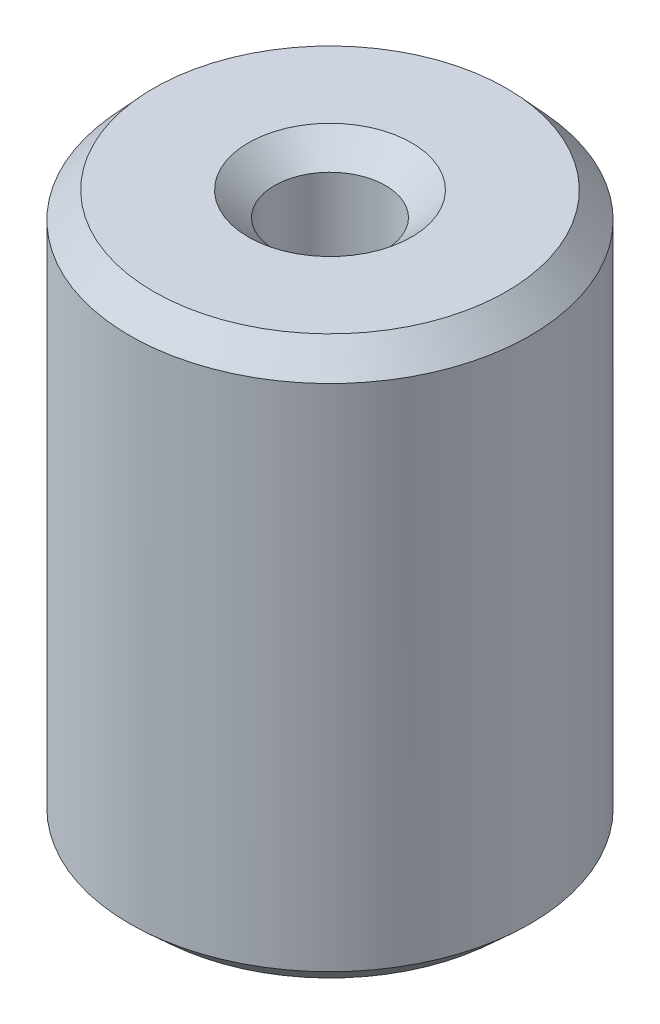
ISO-10303-21;
HEADER;
FILE_DESCRIPTION(('STEP AP214'),'2;1');
FILE_NAME('part.step','',(''),(''),'','','');
FILE_SCHEMA(('AUTOMOTIVE_DESIGN { 1 0 10303 214 1 1 1 1 }'));
ENDSEC;
DATA;
#1=APPLICATION_CONTEXT('core data for automotive mechanical design processes');
#2=APPLICATION_PROTOCOL_DEFINITION('international standard','automotive_design',2000,#1);
#3=PRODUCT_CONTEXT('',#1,'mechanical');
#4=PRODUCT('Part','Part','',(#3));
#5=PRODUCT_RELATED_PRODUCT_CATEGORY('part','',(#4));
#6=PRODUCT_DEFINITION_FORMATION('','',#4);
#7=PRODUCT_DEFINITION_CONTEXT('part definition',#1,'design');
#8=PRODUCT_DEFINITION('design','',#6,#7);
#9=PRODUCT_DEFINITION_SHAPE('','',#8);
#10=(LENGTH_UNIT() NAMED_UNIT(*) SI_UNIT(.MILLI.,.METRE.));
#11=(NAMED_UNIT(*) PLANE_ANGLE_UNIT() SI_UNIT($,.RADIAN.));
#12=(NAMED_UNIT(*) SI_UNIT($,.STERADIAN.) SOLID_ANGLE_UNIT());
#13=UNCERTAINTY_MEASURE_WITH_UNIT(LENGTH_MEASURE(1.E-05),#10,'distance_accuracy_value','');
#14=(GEOMETRIC_REPRESENTATION_CONTEXT(3) GLOBAL_UNCERTAINTY_ASSIGNED_CONTEXT((#13)) GLOBAL_UNIT_ASSIGNED_CONTEXT((#10,
#11,#12)) REPRESENTATION_CONTEXT('',''));
#15=CARTESIAN_POINT('',(0.,0.,0.));
#16=DIRECTION('',(0.,0.,1.));
#17=DIRECTION('',(1.,0.,0.));
#18=AXIS2_PLACEMENT_3D('',#15,#16,#17);
#19=CARTESIAN_POINT('',(0.,13.9698133571236,0.));
#20=DIRECTION('',(0.,-1.,0.));
#21=DIRECTION('',(0.,0.,-1.));
#22=AXIS2_PLACEMENT_3D('',#19,#20,#21);
#23=CYLINDRICAL_SURFACE('',#22,5.);
#24=CARTESIAN_POINT('',(0.,0.59749791350701,0.));
#25=DIRECTION('',(0.,1.,0.));
#26=DIRECTION('',(0.,0.,1.));
#27=AXIS2_PLACEMENT_3D('',#24,#25,#26);
#28=CIRCLE('',#27,5.);
#29=CARTESIAN_POINT('',(0.,0.59749791350701,5.));
#30=VERTEX_POINT('',#29);
#31=EDGE_CURVE('E10',#30,#30,#28,.T.);
#32=ORIENTED_EDGE('',*,*,#31,.T.);
#33=EDGE_LOOP('',(#32));
#34=FACE_BOUND('',#33,.T.);
#35=CARTESIAN_POINT('',(0.,13.3173487193047,0.));
#36=DIRECTION('',(0.,1.,0.));
#37=DIRECTION('',(0.,0.,1.));
#38=AXIS2_PLACEMENT_3D('',#35,#36,#37);
#39=CIRCLE('',#38,5.);
#40=CARTESIAN_POINT('',(0.,13.3173487193047,-5.));
#41=VERTEX_POINT('',#40);
#42=EDGE_CURVE('E50',#41,#41,#39,.F.);
#43=ORIENTED_EDGE('',*,*,#42,.T.);
#44=EDGE_LOOP('',(#43));
#45=FACE_BOUND('',#44,.T.);
#46=ADVANCED_FACE('F39',(#34,#45),#23,.T.);
#47=CARTESIAN_POINT('',(0.,13.9698133571236,0.));
#48=DIRECTION('',(0.,1.,0.));
#49=DIRECTION('',(0.,0.,1.));
#50=AXIS2_PLACEMENT_3D('',#47,#48,#49);
#51=PLANE('',#50);
#52=CARTESIAN_POINT('',(0.,13.9698133571236,0.));
#53=DIRECTION('',(0.,1.,0.));
#54=DIRECTION('',(0.,0.,1.));
#55=AXIS2_PLACEMENT_3D('',#52,#53,#54);
#56=CIRCLE('',#55,2.03883993069942);
#57=CARTESIAN_POINT('',(0.,13.9698133571236,2.03883993069942));
#58=VERTEX_POINT('',#57);
#59=EDGE_CURVE('E58',#58,#58,#56,.F.);
#60=ORIENTED_EDGE('',*,*,#59,.T.);
#61=EDGE_LOOP('',(#60));
#62=FACE_BOUND('',#61,.T.);
#63=CARTESIAN_POINT('',(0.,13.9698133571236,0.));
#64=DIRECTION('',(0.,1.,0.));
#65=DIRECTION('',(0.,0.,1.));
#66=AXIS2_PLACEMENT_3D('',#63,#64,#65);
#67=CIRCLE('',#66,4.40250208649299);
#68=CARTESIAN_POINT('',(0.,13.9698133571236,-4.402502086493));
#69=VERTEX_POINT('',#68);
#70=EDGE_CURVE('E61',#69,#69,#67,.T.);
#71=ORIENTED_EDGE('',*,*,#70,.T.);
#72=EDGE_LOOP('',(#71));
#73=FACE_BOUND('',#72,.T.);
#74=ADVANCED_FACE('F88',(#62,#73),#51,.T.);
#75=CARTESIAN_POINT('',(0.,0.,0.));
#76=DIRECTION('',(0.,1.,0.));
#77=DIRECTION('',(0.,0.,1.));
#78=AXIS2_PLACEMENT_3D('',#75,#76,#77);
#79=PLANE('',#78);
#80=CARTESIAN_POINT('',(0.,0.,0.));
#81=DIRECTION('',(0.,1.,0.));
#82=DIRECTION('',(0.,0.,1.));
#83=AXIS2_PLACEMENT_3D('',#80,#81,#82);
#84=CIRCLE('',#83,1.98387320638752);
#85=CARTESIAN_POINT('',(0.,0.,1.98387320638752));
#86=VERTEX_POINT('',#85);
#87=EDGE_CURVE('E51',#86,#86,#84,.T.);
#88=ORIENTED_EDGE('',*,*,#87,.T.);
#89=EDGE_LOOP('',(#88));
#90=FACE_BOUND('',#89,.T.);
#91=CARTESIAN_POINT('',(0.,0.,0.));
#92=DIRECTION('',(0.,1.,0.));
#93=DIRECTION('',(0.,0.,1.));
#94=AXIS2_PLACEMENT_3D('',#91,#92,#93);
#95=CIRCLE('',#94,4.34753536218109);
#96=CARTESIAN_POINT('',(0.,0.,4.34753536218109));
#97=VERTEX_POINT('',#96);
#98=EDGE_CURVE('E54',#97,#97,#95,.F.);
#99=ORIENTED_EDGE('',*,*,#98,.T.);
#100=EDGE_LOOP('',(#99));
#101=FACE_BOUND('',#100,.T.);
#102=ADVANCED_FACE('F83',(#90,#101),#79,.F.);
#103=CARTESIAN_POINT('',(0.,13.9698133571236,0.));
#104=DIRECTION('',(0.,-1.,0.));
#105=DIRECTION('',(0.,0.,-1.));
#106=AXIS2_PLACEMENT_3D('',#103,#104,#105);
#107=CYLINDRICAL_SURFACE('',#106,1.38637529288051);
#108=CARTESIAN_POINT('',(0.,13.3723154436166,0.));
#109=DIRECTION('',(0.,1.,0.));
#110=DIRECTION('',(0.,0.,1.));
#111=AXIS2_PLACEMENT_3D('',#108,#109,#110);
#112=CIRCLE('',#111,1.38637529288051);
#113=CARTESIAN_POINT('',(0.,13.3723154436166,1.38637529288051));
#114=VERTEX_POINT('',#113);
#115=EDGE_CURVE('E67',#114,#114,#112,.T.);
#116=ORIENTED_EDGE('',*,*,#115,.T.);
#117=EDGE_LOOP('',(#116));
#118=FACE_BOUND('',#117,.T.);
#119=CARTESIAN_POINT('',(0.,0.652464637818912,0.));
#120=DIRECTION('',(0.,1.,0.));
#121=DIRECTION('',(0.,0.,1.));
#122=AXIS2_PLACEMENT_3D('',#119,#120,#121);
#123=CIRCLE('',#122,1.38637529288051);
#124=CARTESIAN_POINT('',(0.,0.652464637818912,1.38637529288051));
#125=VERTEX_POINT('',#124);
#126=EDGE_CURVE('E69',#125,#125,#123,.F.);
#127=ORIENTED_EDGE('',*,*,#126,.T.);
#128=EDGE_LOOP('',(#127));
#129=FACE_BOUND('',#128,.T.);
#130=ADVANCED_FACE('F71',(#118,#129),#107,.F.);
#131=CARTESIAN_POINT('',(0.,13.3723154436166,0.));
#132=DIRECTION('',(0.,1.,0.));
#133=DIRECTION('',(0.,0.,1.));
#134=AXIS2_PLACEMENT_3D('',#131,#132,#133);
#135=CONICAL_SURFACE('',#134,1.38637529288051,0.829344547417397);
#136=ORIENTED_EDGE('',*,*,#59,.F.);
#137=EDGE_LOOP('',(#136));
#138=FACE_BOUND('',#137,.T.);
#139=ORIENTED_EDGE('',*,*,#115,.F.);
#140=EDGE_LOOP('',(#139));
#141=FACE_BOUND('',#140,.T.);
#142=ADVANCED_FACE('F77',(#138,#141),#135,.F.);
#143=CARTESIAN_POINT('',(0.,0.,0.));
#144=DIRECTION('',(0.,-1.,0.));
#145=DIRECTION('',(0.,0.,-1.));
#146=AXIS2_PLACEMENT_3D('',#143,#144,#145);
#147=CONICAL_SURFACE('',#146,1.98387320638752,0.741451779377498);
#148=ORIENTED_EDGE('',*,*,#126,.F.);
#149=EDGE_LOOP('',(#148));
#150=FACE_BOUND('',#149,.T.);
#151=ORIENTED_EDGE('',*,*,#87,.F.);
#152=EDGE_LOOP('',(#151));
#153=FACE_BOUND('',#152,.T.);
#154=ADVANCED_FACE('F73',(#150,#153),#147,.F.);
#155=CARTESIAN_POINT('',(0.,0.59749791350701,0.));
#156=DIRECTION('',(0.,1.,0.));
#157=DIRECTION('',(0.,0.,1.));
#158=AXIS2_PLACEMENT_3D('',#155,#156,#157);
#159=CONICAL_SURFACE('',#158,5.,0.829344547417397);
#160=ORIENTED_EDGE('',*,*,#98,.F.);
#161=EDGE_LOOP('',(#160));
#162=FACE_BOUND('',#161,.T.);
#163=ORIENTED_EDGE('',*,*,#31,.F.);
#164=EDGE_LOOP('',(#163));
#165=FACE_BOUND('',#164,.T.);
#166=ADVANCED_FACE('F76',(#162,#165),#159,.T.);
#167=CARTESIAN_POINT('',(0.,13.9698133571236,0.));
#168=DIRECTION('',(0.,-1.,0.));
#169=DIRECTION('',(0.,0.,-1.));
#170=AXIS2_PLACEMENT_3D('',#167,#168,#169);
#171=CONICAL_SURFACE('',#170,4.40250208649299,0.741451779377502);
#172=CARTESIAN_POINT('',(0.,13.3173487193047,-5.));
#173=CARTESIAN_POINT('',(0.,13.3241452259487,-4.99377606340097));
#174=CARTESIAN_POINT('',(0.,13.3309417325926,-4.98755212680194));
#175=CARTESIAN_POINT('',(0.,13.3445347458805,-4.97510425360388));
#176=CARTESIAN_POINT('',(0.,13.3513312525245,-4.96888031700484));
#177=CARTESIAN_POINT('',(0.,13.3649242658123,-4.95643244380678));
#178=CARTESIAN_POINT('',(0.,13.3717207724563,-4.95020850720775));
#179=CARTESIAN_POINT('',(0.,13.3853137857442,-4.93776063400969));
#180=CARTESIAN_POINT('',(0.,13.3921102923881,-4.93153669741066));
#181=CARTESIAN_POINT('',(0.,13.405703305676,-4.91908882421259));
#182=CARTESIAN_POINT('',(0.,13.41249981232,-4.91286488761356));
#183=CARTESIAN_POINT('',(0.,13.4260928256079,-4.9004170144155));
#184=CARTESIAN_POINT('',(0.,13.4328893322518,-4.89419307781647));
#185=CARTESIAN_POINT('',(0.,13.4464823455397,-4.88174520461841));
#186=CARTESIAN_POINT('',(0.,13.4532788521837,-4.87552126801937));
#187=CARTESIAN_POINT('',(0.,13.4668718654715,-4.86307339482131));
#188=CARTESIAN_POINT('',(0.,13.4736683721155,-4.85684945822228));
#189=CARTESIAN_POINT('',(0.,13.4872613854034,-4.84440158502422));
#190=CARTESIAN_POINT('',(0.,13.4940578920473,-4.83817764842519));
#191=CARTESIAN_POINT('',(0.,13.5076509053352,-4.82572977522712));
#192=CARTESIAN_POINT('',(0.,13.5144474119792,-4.81950583862809));
#193=CARTESIAN_POINT('',(0.,13.5280404252671,-4.80705796543003));
#194=CARTESIAN_POINT('',(0.,13.534836931911,-4.800834028831));
#195=CARTESIAN_POINT('',(0.,13.5484299451989,-4.78838615563294));
#196=CARTESIAN_POINT('',(0.,13.5552264518429,-4.78216221903391));
#197=CARTESIAN_POINT('',(0.,13.5688194651308,-4.76971434583584));
#198=CARTESIAN_POINT('',(0.,13.5756159717747,-4.76349040923681));
#199=CARTESIAN_POINT('',(0.,13.5892089850626,-4.75104253603875));
#200=CARTESIAN_POINT('',(0.,13.5960054917065,-4.74481859943972));
#201=CARTESIAN_POINT('',(0.,13.6095985049944,-4.73237072624165));
#202=CARTESIAN_POINT('',(0.,13.6163950116384,-4.72614678964262));
#203=CARTESIAN_POINT('',(0.,13.6299880249263,-4.71369891644456));
#204=CARTESIAN_POINT('',(0.,13.6367845315702,-4.70747497984553));
#205=CARTESIAN_POINT('',(0.,13.6503775448581,-4.69502710664747));
#206=CARTESIAN_POINT('',(0.,13.6571740515021,-4.68880317004844));
#207=CARTESIAN_POINT('',(0.,13.67076706479,-4.67635529685037));
#208=CARTESIAN_POINT('',(0.,13.6775635714339,-4.67013136025134));
#209=CARTESIAN_POINT('',(0.,13.6911565847218,-4.65768348705328));
#210=CARTESIAN_POINT('',(0.,13.6979530913657,-4.65145955045425));
#211=CARTESIAN_POINT('',(0.,13.7115461046536,-4.63901167725618));
#212=CARTESIAN_POINT('',(0.,13.7183426112976,-4.63278774065715));
#213=CARTESIAN_POINT('',(0.,13.7319356245855,-4.62033986745909));
#214=CARTESIAN_POINT('',(0.,13.7387321312294,-4.61411593086006));
#215=CARTESIAN_POINT('',(0.,13.7523251445173,-4.601668057662));
#216=CARTESIAN_POINT('',(0.,13.7591216511613,-4.59544412106297));
#217=CARTESIAN_POINT('',(0.,13.7727146644492,-4.5829962478649));
#218=CARTESIAN_POINT('',(0.,13.7795111710931,-4.57677231126587));
#219=CARTESIAN_POINT('',(0.,13.793104184381,-4.56432443806781));
#220=CARTESIAN_POINT('',(0.,13.799900691025,-4.55810050146878));
#221=CARTESIAN_POINT('',(0.,13.8134937043128,-4.54565262827072));
#222=CARTESIAN_POINT('',(0.,13.8202902109568,-4.53942869167168));
#223=CARTESIAN_POINT('',(0.,13.8338832242447,-4.52698081847362));
#224=CARTESIAN_POINT('',(0.,13.8406797308886,-4.52075688187459));
#225=CARTESIAN_POINT('',(0.,13.8542727441765,-4.50830900867653));
#226=CARTESIAN_POINT('',(0.,13.8610692508205,-4.5020850720775));
#227=CARTESIAN_POINT('',(0.,13.8746622641084,-4.48963719887943));
#228=CARTESIAN_POINT('',(0.,13.8814587707523,-4.4834132622804));
#229=CARTESIAN_POINT('',(0.,13.8950517840402,-4.47096538908234));
#230=CARTESIAN_POINT('',(0.,13.9018482906842,-4.46474145248331));
#231=CARTESIAN_POINT('',(0.,13.915441303972,-4.45229357928525));
#232=CARTESIAN_POINT('',(0.,13.922237810616,-4.44606964268621));
#233=CARTESIAN_POINT('',(0.,13.9358308239039,-4.43362176948815));
#234=CARTESIAN_POINT('',(0.,13.9426273305478,-4.42739783288912));
#235=CARTESIAN_POINT('',(0.,13.9562203438357,-4.41494995969106));
#236=CARTESIAN_POINT('',(0.,13.9630168504797,-4.40872602309203));
#237=CARTESIAN_POINT('',(0.,13.9698133571236,-4.402502086493));
#238=B_SPLINE_CURVE_WITH_KNOTS('',3,(#172,#173,#174,#175,#176,#177,#178,#179,#180,#181,#182,
#183,#184,#185,#186,#187,#188,#189,#190,#191,#192,#193,#194,#195,#196,#197,#198,#199,#200,#201,
#202,#203,#204,#205,#206,#207,#208,#209,#210,#211,#212,#213,#214,#215,#216,#217,#218,#219,#220,
#221,#222,#223,#224,#225,#226,#227,#228,#229,#230,#231,#232,#233,#234,#235,#236,#237),
.UNSPECIFIED.,.F.,.F.,(4,2,2,2,2,2,2,2,2,2,2,2,2,2,2,2,2,2,2,2,2,2,2,2,2,2,2,2,2,2,2,2,4),(0.,
0.027647224167171,0.0552944483343425,0.0829416725015122,0.110588896668684,0.138236120835853,
0.165883345003024,0.193530569170195,0.221177793337366,0.248825017504536,0.276472241671707,
0.304119465838878,0.331766690006048,0.359413914173219,0.387061138340389,0.41470836250756,
0.44235558667473,0.470002810841901,0.497650035009072,0.525297259176243,0.552944483343414,
0.580591707510584,0.608238931677755,0.635886155844924,0.663533380012096,0.691180604179267,
0.718827828346437,0.746475052513608,0.774122276680778,0.801769500847949,0.829416725015119,
0.857063949182291,0.884711173349462),.UNSPECIFIED.);
#239=EDGE_CURVE('BSEAM45',#41,#69,#238,.T.);
#240=ORIENTED_EDGE('',*,*,#42,.F.);
#241=ORIENTED_EDGE('',*,*,#70,.F.);
#242=ORIENTED_EDGE('',*,*,#239,.T.);
#243=ORIENTED_EDGE('',*,*,#239,.F.);
#244=EDGE_LOOP('',(#240,#242,#241,#243));
#245=FACE_BOUND('',#244,.T.);
#246=ADVANCED_FACE('F45',(#245),#171,.T.);
#247=CLOSED_SHELL('',(#46,#74,#102,#130,#142,#154,#166,#246));
#248=MANIFOLD_SOLID_BREP('B2',#247);
#249=ADVANCED_BREP_SHAPE_REPRESENTATION('',(#18,#248),#14);
#250=SHAPE_DEFINITION_REPRESENTATION(#9,#249);
ENDSEC;
END-ISO-10303-21;
